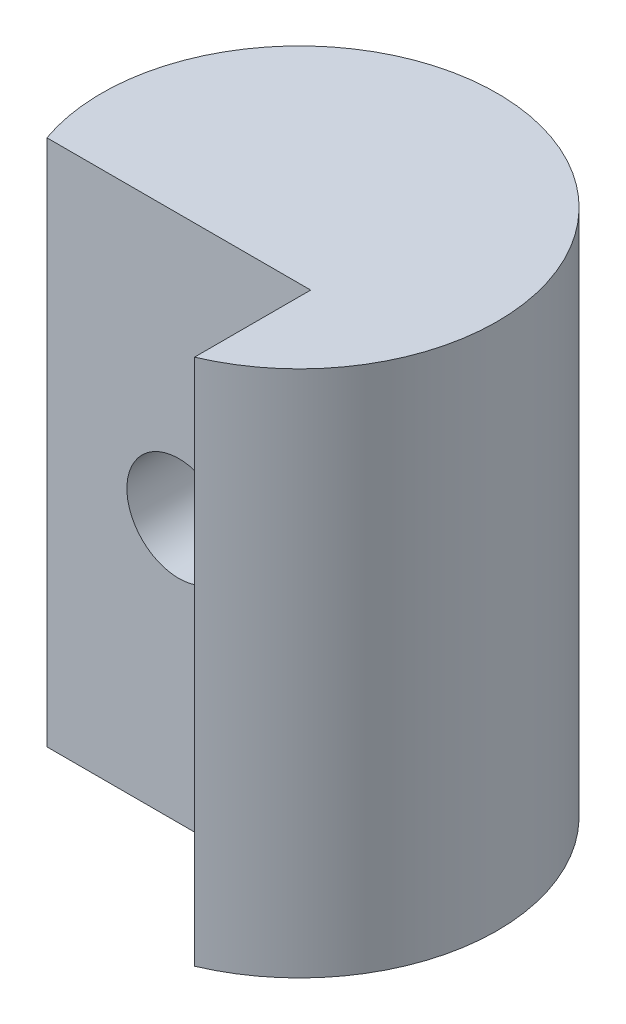
ISO-10303-21;
HEADER;
FILE_DESCRIPTION(('STEP AP214'),'2;1');
FILE_NAME('part.step','',(''),(''),'','','');
FILE_SCHEMA(('AUTOMOTIVE_DESIGN { 1 0 10303 214 1 1 1 1 }'));
ENDSEC;
DATA;
#1=APPLICATION_CONTEXT('core data for automotive mechanical design processes');
#2=APPLICATION_PROTOCOL_DEFINITION('international standard','automotive_design',2000,#1);
#3=PRODUCT_CONTEXT('',#1,'mechanical');
#4=PRODUCT('Part','Part','',(#3));
#5=PRODUCT_RELATED_PRODUCT_CATEGORY('part','',(#4));
#6=PRODUCT_DEFINITION_FORMATION('','',#4);
#7=PRODUCT_DEFINITION_CONTEXT('part definition',#1,'design');
#8=PRODUCT_DEFINITION('design','',#6,#7);
#9=PRODUCT_DEFINITION_SHAPE('','',#8);
#10=(LENGTH_UNIT() NAMED_UNIT(*) SI_UNIT(.MILLI.,.METRE.));
#11=(NAMED_UNIT(*) PLANE_ANGLE_UNIT() SI_UNIT($,.RADIAN.));
#12=(NAMED_UNIT(*) SI_UNIT($,.STERADIAN.) SOLID_ANGLE_UNIT());
#13=UNCERTAINTY_MEASURE_WITH_UNIT(LENGTH_MEASURE(1.E-05),#10,'distance_accuracy_value','');
#14=(GEOMETRIC_REPRESENTATION_CONTEXT(3) GLOBAL_UNCERTAINTY_ASSIGNED_CONTEXT((#13)) GLOBAL_UNIT_ASSIGNED_CONTEXT((#10,
#11,#12)) REPRESENTATION_CONTEXT('',''));
#15=CARTESIAN_POINT('',(0.,0.,0.));
#16=DIRECTION('',(0.,0.,1.));
#17=DIRECTION('',(1.,0.,0.));
#18=AXIS2_PLACEMENT_3D('',#15,#16,#17);
#19=CARTESIAN_POINT('',(0.,12.7,0.));
#20=DIRECTION('',(0.,-1.,0.));
#21=DIRECTION('',(0.,0.,-1.));
#22=AXIS2_PLACEMENT_3D('',#19,#20,#21);
#23=CYLINDRICAL_SURFACE('',#22,4.7625);
#24=CARTESIAN_POINT('',(-0.0651280605345845,6.35,-4.76205466009484));
#25=CARTESIAN_POINT('',(-0.0651297987445977,6.42018066541571,-4.76205543301589));
#26=CARTESIAN_POINT('',(-0.0710549660296495,6.49038201660358,-4.76198487685001));
#27=CARTESIAN_POINT('',(-0.0945979493239067,6.62882084846931,-4.76157454855755));
#28=CARTESIAN_POINT('',(-0.112221659388023,6.69705732109499,-4.76123464070729));
#29=CARTESIAN_POINT('',(-0.158662464759702,6.82960087932602,-4.75991270568545));
#30=CARTESIAN_POINT('',(-0.18747877440105,6.89390824036934,-4.75893072358108));
#31=CARTESIAN_POINT('',(-0.255472281436611,7.01675131198584,-4.75576419353884));
#32=CARTESIAN_POINT('',(-0.294648306020587,7.07528767485729,-4.75357978169627));
#33=CARTESIAN_POINT('',(-0.382057628477239,7.18472569894631,-4.74735144313241));
#34=CARTESIAN_POINT('',(-0.430260343987761,7.23565212468234,-4.7433137302487));
#35=CARTESIAN_POINT('',(-0.534331631547661,7.32863405360331,-4.73271852640439));
#36=CARTESIAN_POINT('',(-0.590199358655011,7.37069053325987,-4.72616131303422));
#37=CARTESIAN_POINT('',(-0.707159753996496,7.44434757126884,-4.71007124589263));
#38=CARTESIAN_POINT('',(-0.768185759585653,7.47606162427444,-4.70057308855907));
#39=CARTESIAN_POINT('',(-0.894074797680816,7.52892960968754,-4.67826025268321));
#40=CARTESIAN_POINT('',(-0.958937628722125,7.55008409600906,-4.66544574815721));
#41=CARTESIAN_POINT('',(-1.09053214917541,7.58151768574684,-4.63645183400836));
#42=CARTESIAN_POINT('',(-1.15726450630432,7.59179285135487,-4.62027120853993));
#43=CARTESIAN_POINT('',(-1.29067961156811,7.60155075413233,-4.58479232176652));
#44=CARTESIAN_POINT('',(-1.35736234855188,7.601031539633,-4.5654934973041));
#45=CARTESIAN_POINT('',(-1.49164080214462,7.58938144823104,-4.52344558732496));
#46=CARTESIAN_POINT('',(-1.55916540653804,7.57782469797012,-4.50058896678677));
#47=CARTESIAN_POINT('',(-1.69076422465707,7.54415894033323,-4.45282280735539));
#48=CARTESIAN_POINT('',(-1.75483728772094,7.52204643785318,-4.42791259075989));
#49=CARTESIAN_POINT('',(-1.88272080876343,7.46604592551683,-4.37514479021686));
#50=CARTESIAN_POINT('',(-1.94617417127887,7.43141928014652,-4.34720454535606));
#51=CARTESIAN_POINT('',(-2.06626452665743,7.35174449866451,-4.29142733151653));
#52=CARTESIAN_POINT('',(-2.12289742080378,7.30669014313014,-4.26359043428508));
#53=CARTESIAN_POINT('',(-2.2302564981634,7.20483762149983,-4.20846258276076));
#54=CARTESIAN_POINT('',(-2.28062341738713,7.14761736751767,-4.18124672756108));
#55=CARTESIAN_POINT('',(-2.37076442193218,7.02378556390812,-4.13080573725349));
#56=CARTESIAN_POINT('',(-2.41054311128401,6.95717811540393,-4.10757886919682));
#57=CARTESIAN_POINT('',(-2.47519981515963,6.82115882086539,-4.06892083731522));
#58=CARTESIAN_POINT('',(-2.50093728579861,6.75228455493171,-4.05305227727553));
#59=CARTESIAN_POINT('',(-2.54002562475447,6.60990337082558,-4.02867512940236));
#60=CARTESIAN_POINT('',(-2.55339754941002,6.53640455629419,-4.02015403181753));
#61=CARTESIAN_POINT('',(-2.56577345415971,6.3990257466516,-4.01226261357099));
#62=CARTESIAN_POINT('',(-2.566648294844,6.33537673097288,-4.01170087096489));
#63=CARTESIAN_POINT('',(-2.55875516044308,6.20893196695127,-4.01674009975389));
#64=CARTESIAN_POINT('',(-2.54998844006967,6.14613610865859,-4.02234026926395));
#65=CARTESIAN_POINT('',(-2.52411268759651,6.02695359504406,-4.03862273432121));
#66=CARTESIAN_POINT('',(-2.50752499234408,5.97040724356058,-4.04898653329317));
#67=CARTESIAN_POINT('',(-2.46698617870377,5.8609914314426,-4.07381246759009));
#68=CARTESIAN_POINT('',(-2.44303325834747,5.80812287449932,-4.08827560578736));
#69=CARTESIAN_POINT('',(-2.38605571454001,5.70227121287755,-4.12181163045025));
#70=CARTESIAN_POINT('',(-2.3523989461431,5.64972563864828,-4.14118631712175));
#71=CARTESIAN_POINT('',(-2.27825366314635,5.5508031561765,-4.1824355755871));
#72=CARTESIAN_POINT('',(-2.23776133879767,5.50442971384751,-4.20431153924392));
#73=CARTESIAN_POINT('',(-2.14457391179227,5.41223200961807,-4.25268618520403));
#74=CARTESIAN_POINT('',(-2.09096144472904,5.36744375071908,-4.27939748162949));
#75=CARTESIAN_POINT('',(-1.97715162570866,5.2874236381527,-4.33315620765059));
#76=CARTESIAN_POINT('',(-1.91695082893795,5.25219681765845,-4.36020380647303));
#77=CARTESIAN_POINT('',(-1.78624939432311,5.18974649056827,-4.41544204506483));
#78=CARTESIAN_POINT('',(-1.71531148949824,5.16336368064236,-4.4435568012239));
#79=CARTESIAN_POINT('',(-1.56896016836813,5.12369958580913,-4.4973147826739));
#80=CARTESIAN_POINT('',(-1.49354756701433,5.11041592294468,-4.52295845579061));
#81=CARTESIAN_POINT('',(-1.34286483944348,5.09809743904433,-4.56991766863307));
#82=CARTESIAN_POINT('',(-1.26766621635121,5.09862359045805,-4.59134477971017));
#83=CARTESIAN_POINT('',(-1.11757948222599,5.11341139716224,-4.63016420562713));
#84=CARTESIAN_POINT('',(-1.0426912279679,5.12766578575207,-4.64755864901583));
#85=CARTESIAN_POINT('',(-0.901468203944166,5.16831605048216,-4.67691980867894));
#86=CARTESIAN_POINT('',(-0.834912452254592,5.19372498287036,-4.6891949995959));
#87=CARTESIAN_POINT('',(-0.706659634005278,5.2557712792487,-4.71022947785537));
#88=CARTESIAN_POINT('',(-0.644961450330825,5.29240605205001,-4.71898957548781));
#89=CARTESIAN_POINT('',(-0.53084367295508,5.37422724300682,-4.73315896213037));
#90=CARTESIAN_POINT('',(-0.478152600730149,5.41901547676527,-4.73868769022512));
#91=CARTESIAN_POINT('',(-0.380780986929212,5.51678031664756,-4.74750533412474));
#92=CARTESIAN_POINT('',(-0.336101179974332,5.56975767287319,-4.75079404460064));
#93=CARTESIAN_POINT('',(-0.255988522592186,5.68252768662879,-4.75578550933461));
#94=CARTESIAN_POINT('',(-0.220575950248994,5.74233488515006,-4.75748480627713));
#95=CARTESIAN_POINT('',(-0.160144548975604,5.8669820772063,-4.75990332876355));
#96=CARTESIAN_POINT('',(-0.135121251611708,5.93181989279844,-4.76062297595955));
#97=CARTESIAN_POINT('',(-0.0989108235067634,6.05529479611925,-4.76150191200019));
#98=CARTESIAN_POINT('',(-0.0862657402619412,6.11350900259026,-4.76172614374641));
#99=CARTESIAN_POINT('',(-0.0693735611813137,6.23114384879228,-4.76200219176691));
#100=CARTESIAN_POINT('',(-0.0651265884571989,6.2905645061963,-4.76205400551364));
#101=CARTESIAN_POINT('',(-0.0651280605345845,6.35,-4.76205466009484));
#102=B_SPLINE_CURVE_WITH_KNOTS('',3,(#24,#25,#26,#27,#28,#29,#30,#31,#32,#33,#34,#35,#36,#37,
#38,#39,#40,#41,#42,#43,#44,#45,#46,#47,#48,#49,#50,#51,#52,#53,#54,#55,#56,#57,#58,#59,#60,#61,
#62,#63,#64,#65,#66,#67,#68,#69,#70,#71,#72,#73,#74,#75,#76,#77,#78,#79,#80,#81,#82,#83,#84,#85,
#86,#87,#88,#89,#90,#91,#92,#93,#94,#95,#96,#97,#98,#99,#100,#101),.UNSPECIFIED.,.T.,.F.,(4,2,2,
2,2,2,2,2,2,2,2,2,2,2,2,2,2,2,2,2,2,2,2,2,2,2,2,2,2,2,2,2,2,2,2,2,2,2,4),(0.,0.210329862714896,
0.420765776044957,0.631186920463172,0.841584253560127,1.05128125203228,1.2609551533884,
1.46824400832163,1.67552198854073,1.88287496813021,2.09026543832578,2.30599543057931,
2.52179690256252,2.7532727019791,2.98488691843391,3.22647260374773,3.46795306924448,
3.69223532113141,3.91613495292441,4.10609137328508,4.29602307644882,4.47477669464699,
4.65357408136639,4.84883178576851,5.04419867715786,5.2676325896916,5.491183891477,
5.73220726002569,5.97318686627446,6.20651505391455,6.43971980292804,6.6554970676612,
6.87122456338104,7.07836990556514,7.28553423296595,7.49314814636012,7.70067267214449,
7.87879688803009,8.05692371509956),.UNSPECIFIED.);
#103=CARTESIAN_POINT('',(-0.0651280605345845,6.35,-4.76205466009484));
#104=VERTEX_POINT('',#103);
#105=EDGE_CURVE('E39',#104,#104,#102,.T.);
#106=ORIENTED_EDGE('',*,*,#105,.T.);
#107=EDGE_LOOP('',(#106));
#108=FACE_BOUND('',#107,.T.);
#109=CARTESIAN_POINT('',(0.,12.7,0.));
#110=DIRECTION('',(0.,1.,0.));
#111=DIRECTION('',(0.,0.,1.));
#112=AXIS2_PLACEMENT_3D('',#109,#110,#111);
#113=CIRCLE('',#112,4.7625);
#114=CARTESIAN_POINT('',(1.85987193946542,12.7,4.38432236711548));
#115=VERTEX_POINT('',#114);
#116=CARTESIAN_POINT('',(-4.49012806053458,12.7,1.5875));
#117=VERTEX_POINT('',#116);
#118=EDGE_CURVE('E11',#115,#117,#113,.T.);
#119=ORIENTED_EDGE('',*,*,#118,.F.);
#120=DIRECTION('',(0.,-1.,0.));
#121=VECTOR('',#120,1.);
#122=CARTESIAN_POINT('',(1.85987193946542,12.7,4.38432236711548));
#123=LINE('',#122,#121);
#124=CARTESIAN_POINT('',(1.85987193946542,0.,4.38432236711548));
#125=VERTEX_POINT('',#124);
#126=EDGE_CURVE('E63',#125,#115,#123,.F.);
#127=ORIENTED_EDGE('',*,*,#126,.F.);
#128=CARTESIAN_POINT('',(0.,0.,0.));
#129=DIRECTION('',(0.,1.,0.));
#130=DIRECTION('',(0.,0.,1.));
#131=AXIS2_PLACEMENT_3D('',#128,#129,#130);
#132=CIRCLE('',#131,4.7625);
#133=CARTESIAN_POINT('',(-4.49012806053458,0.,1.5875));
#134=VERTEX_POINT('',#133);
#135=EDGE_CURVE('E47',#125,#134,#132,.T.);
#136=ORIENTED_EDGE('',*,*,#135,.T.);
#137=DIRECTION('',(0.,-1.,0.));
#138=VECTOR('',#137,1.);
#139=CARTESIAN_POINT('',(-4.49012806053458,12.7,1.5875));
#140=LINE('',#139,#138);
#141=EDGE_CURVE('E55',#117,#134,#140,.T.);
#142=ORIENTED_EDGE('',*,*,#141,.F.);
#143=EDGE_LOOP('',(#119,#127,#136,#142));
#144=FACE_BOUND('',#143,.T.);
#145=ADVANCED_FACE('F35',(#108,#144),#23,.T.);
#146=CARTESIAN_POINT('',(0.,12.7,0.));
#147=DIRECTION('',(0.,1.,0.));
#148=DIRECTION('',(0.,0.,1.));
#149=AXIS2_PLACEMENT_3D('',#146,#147,#148);
#150=PLANE('',#149);
#151=DIRECTION('',(0.,0.,1.));
#152=VECTOR('',#151,1.);
#153=CARTESIAN_POINT('',(1.85987193946542,12.7,1.5875));
#154=LINE('',#153,#152);
#155=CARTESIAN_POINT('',(1.85987193946542,12.7,1.5875));
#156=VERTEX_POINT('',#155);
#157=EDGE_CURVE('E81',#156,#115,#154,.T.);
#158=ORIENTED_EDGE('',*,*,#157,.T.);
#159=ORIENTED_EDGE('',*,*,#118,.T.);
#160=DIRECTION('',(1.,0.,0.));
#161=VECTOR('',#160,1.);
#162=CARTESIAN_POINT('',(1.85987193946542,12.7,1.5875));
#163=LINE('',#162,#161);
#164=EDGE_CURVE('E86',#117,#156,#163,.T.);
#165=ORIENTED_EDGE('',*,*,#164,.T.);
#166=EDGE_LOOP('',(#158,#159,#165));
#167=FACE_BOUND('',#166,.T.);
#168=ADVANCED_FACE('F114',(#167),#150,.T.);
#169=CARTESIAN_POINT('',(0.,0.,0.));
#170=DIRECTION('',(0.,1.,0.));
#171=DIRECTION('',(0.,0.,1.));
#172=AXIS2_PLACEMENT_3D('',#169,#170,#171);
#173=PLANE('',#172);
#174=ORIENTED_EDGE('',*,*,#135,.F.);
#175=DIRECTION('',(0.,0.,1.));
#176=VECTOR('',#175,1.);
#177=CARTESIAN_POINT('',(1.85987193946542,0.,1.5875));
#178=LINE('',#177,#176);
#179=CARTESIAN_POINT('',(1.85987193946542,0.,1.5875));
#180=VERTEX_POINT('',#179);
#181=EDGE_CURVE('E75',#180,#125,#178,.T.);
#182=ORIENTED_EDGE('',*,*,#181,.F.);
#183=DIRECTION('',(1.,0.,0.));
#184=VECTOR('',#183,1.);
#185=CARTESIAN_POINT('',(1.85987193946542,0.,1.5875));
#186=LINE('',#185,#184);
#187=EDGE_CURVE('E80',#134,#180,#186,.T.);
#188=ORIENTED_EDGE('',*,*,#187,.F.);
#189=EDGE_LOOP('',(#174,#182,#188));
#190=FACE_BOUND('',#189,.T.);
#191=ADVANCED_FACE('F88',(#190),#173,.F.);
#192=CARTESIAN_POINT('',(1.85987193946542,12.701,1.5875));
#193=DIRECTION('',(1.,0.,0.));
#194=DIRECTION('',(0.,0.,-1.));
#195=AXIS2_PLACEMENT_3D('',#192,#193,#194);
#196=PLANE('',#195);
#197=ORIENTED_EDGE('',*,*,#126,.T.);
#198=ORIENTED_EDGE('',*,*,#157,.F.);
#199=DIRECTION('',(0.,-1.,0.));
#200=VECTOR('',#199,1.);
#201=CARTESIAN_POINT('',(1.85987193946542,12.701,1.5875));
#202=LINE('',#201,#200);
#203=EDGE_CURVE('E77',#156,#180,#202,.T.);
#204=ORIENTED_EDGE('',*,*,#203,.T.);
#205=ORIENTED_EDGE('',*,*,#181,.T.);
#206=EDGE_LOOP('',(#197,#198,#204,#205));
#207=FACE_BOUND('',#206,.T.);
#208=ADVANCED_FACE('F76',(#207),#196,.F.);
#209=CARTESIAN_POINT('',(1.85987193946542,12.701,1.5875));
#210=DIRECTION('',(0.,0.,-1.));
#211=DIRECTION('',(-1.,0.,0.));
#212=AXIS2_PLACEMENT_3D('',#209,#210,#211);
#213=PLANE('',#212);
#214=CARTESIAN_POINT('',(-1.31512806053458,6.35,1.5875));
#215=DIRECTION('',(0.,0.,1.));
#216=DIRECTION('',(1.,0.,0.));
#217=AXIS2_PLACEMENT_3D('',#214,#215,#216);
#218=CIRCLE('',#217,1.24999999999999);
#219=CARTESIAN_POINT('',(-0.0651280605345899,6.35,1.5875));
#220=VERTEX_POINT('',#219);
#221=EDGE_CURVE('E96',#220,#220,#218,.T.);
#222=ORIENTED_EDGE('',*,*,#221,.F.);
#223=EDGE_LOOP('',(#222));
#224=FACE_BOUND('',#223,.T.);
#225=ORIENTED_EDGE('',*,*,#141,.T.);
#226=ORIENTED_EDGE('',*,*,#187,.T.);
#227=ORIENTED_EDGE('',*,*,#203,.F.);
#228=ORIENTED_EDGE('',*,*,#164,.F.);
#229=EDGE_LOOP('',(#225,#226,#227,#228));
#230=FACE_BOUND('',#229,.T.);
#231=ADVANCED_FACE('F106',(#224,#230),#213,.F.);
#232=CARTESIAN_POINT('',(-1.31512806053458,6.35,1.5875));
#233=DIRECTION('',(0.,0.,1.));
#234=DIRECTION('',(1.,0.,0.));
#235=AXIS2_PLACEMENT_3D('',#232,#233,#234);
#236=CYLINDRICAL_SURFACE('',#235,1.24999999999999);
#237=ORIENTED_EDGE('',*,*,#221,.T.);
#238=EDGE_LOOP('',(#237));
#239=FACE_BOUND('',#238,.T.);
#240=ORIENTED_EDGE('',*,*,#105,.F.);
#241=EDGE_LOOP('',(#240));
#242=FACE_BOUND('',#241,.T.);
#243=ADVANCED_FACE('F104',(#239,#242),#236,.F.);
#244=CLOSED_SHELL('',(#145,#168,#191,#208,#231,#243));
#245=MANIFOLD_SOLID_BREP('B2',#244);
#246=ADVANCED_BREP_SHAPE_REPRESENTATION('',(#18,#245),#14);
#247=SHAPE_DEFINITION_REPRESENTATION(#9,#246);
ENDSEC;
END-ISO-10303-21;
